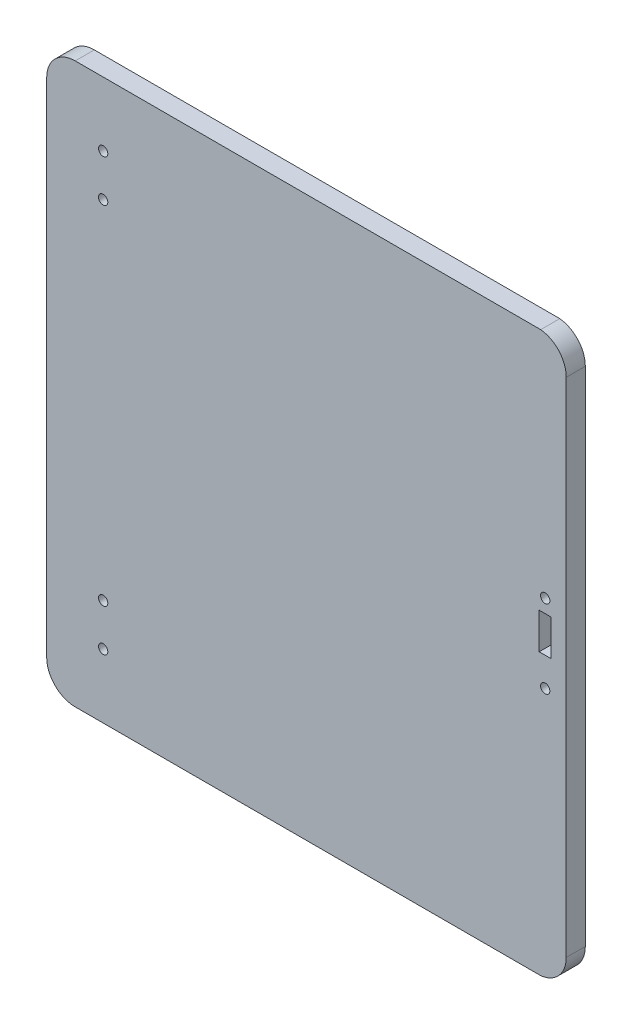
ISO-10303-21;
HEADER;
FILE_DESCRIPTION(('STEP AP214'),'2;1');
FILE_NAME('part.step','',(''),(''),'','','');
FILE_SCHEMA(('AUTOMOTIVE_DESIGN { 1 0 10303 214 1 1 1 1 }'));
ENDSEC;
DATA;
#1=APPLICATION_CONTEXT('core data for automotive mechanical design processes');
#2=APPLICATION_PROTOCOL_DEFINITION('international standard','automotive_design',2000,#1);
#3=PRODUCT_CONTEXT('',#1,'mechanical');
#4=PRODUCT('Part','Part','',(#3));
#5=PRODUCT_RELATED_PRODUCT_CATEGORY('part','',(#4));
#6=PRODUCT_DEFINITION_FORMATION('','',#4);
#7=PRODUCT_DEFINITION_CONTEXT('part definition',#1,'design');
#8=PRODUCT_DEFINITION('design','',#6,#7);
#9=PRODUCT_DEFINITION_SHAPE('','',#8);
#10=(LENGTH_UNIT() NAMED_UNIT(*) SI_UNIT(.MILLI.,.METRE.));
#11=(NAMED_UNIT(*) PLANE_ANGLE_UNIT() SI_UNIT($,.RADIAN.));
#12=(NAMED_UNIT(*) SI_UNIT($,.STERADIAN.) SOLID_ANGLE_UNIT());
#13=UNCERTAINTY_MEASURE_WITH_UNIT(LENGTH_MEASURE(1.E-05),#10,'distance_accuracy_value','');
#14=(GEOMETRIC_REPRESENTATION_CONTEXT(3) GLOBAL_UNCERTAINTY_ASSIGNED_CONTEXT((#13)) GLOBAL_UNIT_ASSIGNED_CONTEXT((#10,
#11,#12)) REPRESENTATION_CONTEXT('',''));
#15=CARTESIAN_POINT('',(0.,0.,0.));
#16=DIRECTION('',(0.,0.,1.));
#17=DIRECTION('',(1.,0.,0.));
#18=AXIS2_PLACEMENT_3D('',#15,#16,#17);
#19=CARTESIAN_POINT('',(76.5001465221911,83.70276267775,6.35));
#20=DIRECTION('',(0.,0.,-1.));
#21=DIRECTION('',(-1.,0.,0.));
#22=AXIS2_PLACEMENT_3D('',#19,#20,#21);
#23=CYLINDRICAL_SURFACE('',#22,9.50000000000003);
#24=CARTESIAN_POINT('',(76.5001465221911,83.70276267775,0.));
#25=DIRECTION('',(0.,0.,1.));
#26=DIRECTION('',(1.,0.,0.));
#27=AXIS2_PLACEMENT_3D('',#24,#25,#26);
#28=CIRCLE('',#27,9.50000000000003);
#29=CARTESIAN_POINT('',(86.,83.65,0.));
#30=VERTEX_POINT('',#29);
#31=CARTESIAN_POINT('',(77.4999999999999,93.15,0.));
#32=VERTEX_POINT('',#31);
#33=EDGE_CURVE('E177',#30,#32,#28,.T.);
#34=ORIENTED_EDGE('',*,*,#33,.T.);
#35=DIRECTION('',(0.,0.,-1.));
#36=VECTOR('',#35,1.);
#37=CARTESIAN_POINT('',(77.4999999999999,93.15,6.35));
#38=LINE('',#37,#36);
#39=CARTESIAN_POINT('',(77.4999999999999,93.15,6.35));
#40=VERTEX_POINT('',#39);
#41=EDGE_CURVE('E11',#40,#32,#38,.T.);
#42=ORIENTED_EDGE('',*,*,#41,.F.);
#43=CARTESIAN_POINT('',(76.5001465221911,83.70276267775,6.35));
#44=DIRECTION('',(0.,0.,1.));
#45=DIRECTION('',(1.,0.,0.));
#46=AXIS2_PLACEMENT_3D('',#43,#44,#45);
#47=CIRCLE('',#46,9.50000000000003);
#48=CARTESIAN_POINT('',(86.,83.65,6.35));
#49=VERTEX_POINT('',#48);
#50=EDGE_CURVE('E183',#49,#40,#47,.T.);
#51=ORIENTED_EDGE('',*,*,#50,.F.);
#52=DIRECTION('',(0.,0.,-1.));
#53=VECTOR('',#52,1.);
#54=CARTESIAN_POINT('',(86.,83.65,6.35));
#55=LINE('',#54,#53);
#56=EDGE_CURVE('E209',#49,#30,#55,.T.);
#57=ORIENTED_EDGE('',*,*,#56,.T.);
#58=EDGE_LOOP('',(#34,#42,#51,#57));
#59=FACE_BOUND('',#58,.T.);
#60=ADVANCED_FACE('F40',(#59),#23,.T.);
#61=CARTESIAN_POINT('',(77.4999999999999,93.15,6.35));
#62=DIRECTION('',(0.,-1.,0.));
#63=DIRECTION('',(1.,0.,0.));
#64=AXIS2_PLACEMENT_3D('',#61,#62,#63);
#65=PLANE('',#64);
#66=DIRECTION('',(-1.,0.,0.));
#67=VECTOR('',#66,1.);
#68=CARTESIAN_POINT('',(77.4999999999999,93.15,0.));
#69=LINE('',#68,#67);
#70=CARTESIAN_POINT('',(-77.4999999999999,93.15,0.));
#71=VERTEX_POINT('',#70);
#72=EDGE_CURVE('E213',#32,#71,#69,.T.);
#73=ORIENTED_EDGE('',*,*,#72,.T.);
#74=DIRECTION('',(0.,0.,-1.));
#75=VECTOR('',#74,1.);
#76=CARTESIAN_POINT('',(-77.4999999999999,93.15,6.35));
#77=LINE('',#76,#75);
#78=CARTESIAN_POINT('',(-77.4999999999999,93.15,6.35));
#79=VERTEX_POINT('',#78);
#80=EDGE_CURVE('E48',#79,#71,#77,.T.);
#81=ORIENTED_EDGE('',*,*,#80,.F.);
#82=DIRECTION('',(-1.,0.,0.));
#83=VECTOR('',#82,1.);
#84=CARTESIAN_POINT('',(77.4999999999999,93.15,6.35));
#85=LINE('',#84,#83);
#86=EDGE_CURVE('E187',#40,#79,#85,.T.);
#87=ORIENTED_EDGE('',*,*,#86,.F.);
#88=ORIENTED_EDGE('',*,*,#41,.T.);
#89=EDGE_LOOP('',(#73,#81,#87,#88));
#90=FACE_BOUND('',#89,.T.);
#91=ADVANCED_FACE('F283',(#90),#65,.F.);
#92=CARTESIAN_POINT('',(-77.5,83.65,6.35));
#93=DIRECTION('',(0.,0.,-1.));
#94=DIRECTION('',(-1.,0.,0.));
#95=AXIS2_PLACEMENT_3D('',#92,#93,#94);
#96=CYLINDRICAL_SURFACE('',#95,9.50000000000001);
#97=CARTESIAN_POINT('',(-77.5,83.65,0.));
#98=DIRECTION('',(0.,0.,1.));
#99=DIRECTION('',(1.,0.,0.));
#100=AXIS2_PLACEMENT_3D('',#97,#98,#99);
#101=CIRCLE('',#100,9.50000000000001);
#102=CARTESIAN_POINT('',(-87.,83.6499999999999,0.));
#103=VERTEX_POINT('',#102);
#104=EDGE_CURVE('E216',#71,#103,#101,.T.);
#105=ORIENTED_EDGE('',*,*,#104,.T.);
#106=DIRECTION('',(0.,0.,-1.));
#107=VECTOR('',#106,1.);
#108=CARTESIAN_POINT('',(-87.,83.6499999999999,6.35));
#109=LINE('',#108,#107);
#110=CARTESIAN_POINT('',(-87.,83.6499999999999,6.35));
#111=VERTEX_POINT('',#110);
#112=EDGE_CURVE('E252',#111,#103,#109,.T.);
#113=ORIENTED_EDGE('',*,*,#112,.F.);
#114=CARTESIAN_POINT('',(-77.5,83.65,6.35));
#115=DIRECTION('',(0.,0.,1.));
#116=DIRECTION('',(1.,0.,0.));
#117=AXIS2_PLACEMENT_3D('',#114,#115,#116);
#118=CIRCLE('',#117,9.50000000000001);
#119=EDGE_CURVE('E191',#79,#111,#118,.T.);
#120=ORIENTED_EDGE('',*,*,#119,.F.);
#121=ORIENTED_EDGE('',*,*,#80,.T.);
#122=EDGE_LOOP('',(#105,#113,#120,#121));
#123=FACE_BOUND('',#122,.T.);
#124=ADVANCED_FACE('F262',(#123),#96,.T.);
#125=CARTESIAN_POINT('',(-87.,83.6499999999999,6.35));
#126=DIRECTION('',(1.,0.,0.));
#127=DIRECTION('',(0.,1.,0.));
#128=AXIS2_PLACEMENT_3D('',#125,#126,#127);
#129=PLANE('',#128);
#130=DIRECTION('',(0.,-1.,0.));
#131=VECTOR('',#130,1.);
#132=CARTESIAN_POINT('',(-87.,83.6499999999999,0.));
#133=LINE('',#132,#131);
#134=CARTESIAN_POINT('',(-87.,-83.65,0.));
#135=VERTEX_POINT('',#134);
#136=EDGE_CURVE('E219',#103,#135,#133,.T.);
#137=ORIENTED_EDGE('',*,*,#136,.T.);
#138=DIRECTION('',(0.,0.,-1.));
#139=VECTOR('',#138,1.);
#140=CARTESIAN_POINT('',(-87.,-83.65,6.35));
#141=LINE('',#140,#139);
#142=CARTESIAN_POINT('',(-87.,-83.65,6.35));
#143=VERTEX_POINT('',#142);
#144=EDGE_CURVE('E248',#143,#135,#141,.T.);
#145=ORIENTED_EDGE('',*,*,#144,.F.);
#146=DIRECTION('',(0.,-1.,0.));
#147=VECTOR('',#146,1.);
#148=CARTESIAN_POINT('',(-87.,83.6499999999999,6.35));
#149=LINE('',#148,#147);
#150=EDGE_CURVE('E194',#111,#143,#149,.T.);
#151=ORIENTED_EDGE('',*,*,#150,.F.);
#152=ORIENTED_EDGE('',*,*,#112,.T.);
#153=EDGE_LOOP('',(#137,#145,#151,#152));
#154=FACE_BOUND('',#153,.T.);
#155=ADVANCED_FACE('F271',(#154),#129,.F.);
#156=CARTESIAN_POINT('',(-77.5,-83.65,6.35));
#157=DIRECTION('',(0.,0.,-1.));
#158=DIRECTION('',(-1.,0.,0.));
#159=AXIS2_PLACEMENT_3D('',#156,#157,#158);
#160=CYLINDRICAL_SURFACE('',#159,9.50000000000001);
#161=CARTESIAN_POINT('',(-77.5,-83.65,0.));
#162=DIRECTION('',(0.,0.,1.));
#163=DIRECTION('',(1.,0.,0.));
#164=AXIS2_PLACEMENT_3D('',#161,#162,#163);
#165=CIRCLE('',#164,9.50000000000001);
#166=CARTESIAN_POINT('',(-77.4999999999999,-93.15,0.));
#167=VERTEX_POINT('',#166);
#168=EDGE_CURVE('E222',#135,#167,#165,.T.);
#169=ORIENTED_EDGE('',*,*,#168,.T.);
#170=DIRECTION('',(0.,0.,-1.));
#171=VECTOR('',#170,1.);
#172=CARTESIAN_POINT('',(-77.4999999999999,-93.15,6.35));
#173=LINE('',#172,#171);
#174=CARTESIAN_POINT('',(-77.4999999999999,-93.15,6.35));
#175=VERTEX_POINT('',#174);
#176=EDGE_CURVE('E244',#175,#167,#173,.T.);
#177=ORIENTED_EDGE('',*,*,#176,.F.);
#178=CARTESIAN_POINT('',(-77.5,-83.65,6.35));
#179=DIRECTION('',(0.,0.,1.));
#180=DIRECTION('',(1.,0.,0.));
#181=AXIS2_PLACEMENT_3D('',#178,#179,#180);
#182=CIRCLE('',#181,9.50000000000001);
#183=EDGE_CURVE('E197',#143,#175,#182,.T.);
#184=ORIENTED_EDGE('',*,*,#183,.F.);
#185=ORIENTED_EDGE('',*,*,#144,.T.);
#186=EDGE_LOOP('',(#169,#177,#184,#185));
#187=FACE_BOUND('',#186,.T.);
#188=ADVANCED_FACE('F275',(#187),#160,.T.);
#189=CARTESIAN_POINT('',(77.4999999999999,-93.15,6.35));
#190=DIRECTION('',(0.,1.,0.));
#191=DIRECTION('',(-1.,0.,0.));
#192=AXIS2_PLACEMENT_3D('',#189,#190,#191);
#193=PLANE('',#192);
#194=DIRECTION('',(1.,0.,0.));
#195=VECTOR('',#194,1.);
#196=CARTESIAN_POINT('',(77.4999999999999,-93.15,0.));
#197=LINE('',#196,#195);
#198=CARTESIAN_POINT('',(77.4999999999999,-93.15,0.));
#199=VERTEX_POINT('',#198);
#200=EDGE_CURVE('E225',#167,#199,#197,.T.);
#201=ORIENTED_EDGE('',*,*,#200,.T.);
#202=DIRECTION('',(0.,0.,-1.));
#203=VECTOR('',#202,1.);
#204=CARTESIAN_POINT('',(77.4999999999999,-93.15,6.35));
#205=LINE('',#204,#203);
#206=CARTESIAN_POINT('',(77.4999999999999,-93.15,6.35));
#207=VERTEX_POINT('',#206);
#208=EDGE_CURVE('E240',#207,#199,#205,.T.);
#209=ORIENTED_EDGE('',*,*,#208,.F.);
#210=DIRECTION('',(1.,0.,0.));
#211=VECTOR('',#210,1.);
#212=CARTESIAN_POINT('',(77.4999999999999,-93.15,6.35));
#213=LINE('',#212,#211);
#214=EDGE_CURVE('E200',#175,#207,#213,.T.);
#215=ORIENTED_EDGE('',*,*,#214,.F.);
#216=ORIENTED_EDGE('',*,*,#176,.T.);
#217=EDGE_LOOP('',(#201,#209,#215,#216));
#218=FACE_BOUND('',#217,.T.);
#219=ADVANCED_FACE('F296',(#218),#193,.F.);
#220=CARTESIAN_POINT('',(76.5001465221912,-83.70276267775,6.35));
#221=DIRECTION('',(0.,0.,-1.));
#222=DIRECTION('',(-1.,0.,0.));
#223=AXIS2_PLACEMENT_3D('',#220,#221,#222);
#224=CYLINDRICAL_SURFACE('',#223,9.49999999999996);
#225=CARTESIAN_POINT('',(76.5001465221912,-83.70276267775,0.));
#226=DIRECTION('',(0.,0.,1.));
#227=DIRECTION('',(1.,0.,0.));
#228=AXIS2_PLACEMENT_3D('',#225,#226,#227);
#229=CIRCLE('',#228,9.49999999999996);
#230=CARTESIAN_POINT('',(86.,-83.6499999999999,0.));
#231=VERTEX_POINT('',#230);
#232=EDGE_CURVE('E228',#199,#231,#229,.T.);
#233=ORIENTED_EDGE('',*,*,#232,.T.);
#234=DIRECTION('',(0.,0.,-1.));
#235=VECTOR('',#234,1.);
#236=CARTESIAN_POINT('',(86.,-83.6499999999999,6.35));
#237=LINE('',#236,#235);
#238=CARTESIAN_POINT('',(86.,-83.6499999999999,6.35));
#239=VERTEX_POINT('',#238);
#240=EDGE_CURVE('E236',#239,#231,#237,.T.);
#241=ORIENTED_EDGE('',*,*,#240,.F.);
#242=CARTESIAN_POINT('',(76.5001465221912,-83.70276267775,6.35));
#243=DIRECTION('',(0.,0.,1.));
#244=DIRECTION('',(1.,0.,0.));
#245=AXIS2_PLACEMENT_3D('',#242,#243,#244);
#246=CIRCLE('',#245,9.49999999999996);
#247=EDGE_CURVE('E203',#207,#239,#246,.T.);
#248=ORIENTED_EDGE('',*,*,#247,.F.);
#249=ORIENTED_EDGE('',*,*,#208,.T.);
#250=EDGE_LOOP('',(#233,#241,#248,#249));
#251=FACE_BOUND('',#250,.T.);
#252=ADVANCED_FACE('F294',(#251),#224,.T.);
#253=CARTESIAN_POINT('',(86.,83.65,6.35));
#254=DIRECTION('',(-1.,0.,0.));
#255=DIRECTION('',(0.,0.,1.));
#256=AXIS2_PLACEMENT_3D('',#253,#254,#255);
#257=PLANE('',#256);
#258=DIRECTION('',(0.,1.,0.));
#259=VECTOR('',#258,1.);
#260=CARTESIAN_POINT('',(86.,83.65,0.));
#261=LINE('',#260,#259);
#262=EDGE_CURVE('E188',#231,#30,#261,.T.);
#263=ORIENTED_EDGE('',*,*,#262,.T.);
#264=ORIENTED_EDGE('',*,*,#56,.F.);
#265=DIRECTION('',(0.,1.,0.));
#266=VECTOR('',#265,1.);
#267=CARTESIAN_POINT('',(86.,83.65,6.35));
#268=LINE('',#267,#266);
#269=EDGE_CURVE('E206',#239,#49,#268,.T.);
#270=ORIENTED_EDGE('',*,*,#269,.F.);
#271=ORIENTED_EDGE('',*,*,#240,.T.);
#272=EDGE_LOOP('',(#263,#264,#270,#271));
#273=FACE_BOUND('',#272,.T.);
#274=ADVANCED_FACE('F289',(#273),#257,.F.);
#275=CARTESIAN_POINT('',(76.5001465221911,83.70276267775,6.35));
#276=DIRECTION('',(0.,0.,1.));
#277=DIRECTION('',(1.,0.,0.));
#278=AXIS2_PLACEMENT_3D('',#275,#276,#277);
#279=PLANE('',#278);
#280=CARTESIAN_POINT('',(79.,16.45,6.35));
#281=DIRECTION('',(0.,0.,1.));
#282=DIRECTION('',(1.,0.,0.));
#283=AXIS2_PLACEMENT_3D('',#280,#281,#282);
#284=CIRCLE('',#283,1.54999999999999);
#285=CARTESIAN_POINT('',(80.55,16.45,6.35));
#286=VERTEX_POINT('',#285);
#287=EDGE_CURVE('E518',#286,#286,#284,.T.);
#288=ORIENTED_EDGE('',*,*,#287,.F.);
#289=EDGE_LOOP('',(#288));
#290=FACE_BOUND('',#289,.T.);
#291=CARTESIAN_POINT('',(79.,-9.55,6.35));
#292=DIRECTION('',(0.,0.,1.));
#293=DIRECTION('',(1.,0.,0.));
#294=AXIS2_PLACEMENT_3D('',#291,#292,#293);
#295=CIRCLE('',#294,1.54999999999999);
#296=CARTESIAN_POINT('',(80.55,-9.55,6.35));
#297=VERTEX_POINT('',#296);
#298=EDGE_CURVE('E527',#297,#297,#295,.T.);
#299=ORIENTED_EDGE('',*,*,#298,.F.);
#300=EDGE_LOOP('',(#299));
#301=FACE_BOUND('',#300,.T.);
#302=CARTESIAN_POINT('',(-68.2,71.8,6.35));
#303=DIRECTION('',(0.,0.,1.));
#304=DIRECTION('',(1.,0.,0.));
#305=AXIS2_PLACEMENT_3D('',#302,#303,#304);
#306=CIRCLE('',#305,1.54999999999999);
#307=CARTESIAN_POINT('',(-66.65,71.8,6.35));
#308=VERTEX_POINT('',#307);
#309=EDGE_CURVE('E536',#308,#308,#306,.T.);
#310=ORIENTED_EDGE('',*,*,#309,.F.);
#311=EDGE_LOOP('',(#310));
#312=FACE_BOUND('',#311,.T.);
#313=CARTESIAN_POINT('',(-68.2,57.8,6.35));
#314=DIRECTION('',(0.,0.,1.));
#315=DIRECTION('',(1.,0.,0.));
#316=AXIS2_PLACEMENT_3D('',#313,#314,#315);
#317=CIRCLE('',#316,1.54999999999999);
#318=CARTESIAN_POINT('',(-66.65,57.8,6.35));
#319=VERTEX_POINT('',#318);
#320=EDGE_CURVE('E544',#319,#319,#317,.T.);
#321=ORIENTED_EDGE('',*,*,#320,.F.);
#322=EDGE_LOOP('',(#321));
#323=FACE_BOUND('',#322,.T.);
#324=CARTESIAN_POINT('',(-68.2,-57.8,6.35));
#325=DIRECTION('',(0.,0.,1.));
#326=DIRECTION('',(-1.,0.,0.));
#327=AXIS2_PLACEMENT_3D('',#324,#325,#326);
#328=CIRCLE('',#327,1.54999999999999);
#329=CARTESIAN_POINT('',(-69.75,-57.8,6.35));
#330=VERTEX_POINT('',#329);
#331=EDGE_CURVE('E552',#330,#330,#328,.T.);
#332=ORIENTED_EDGE('',*,*,#331,.F.);
#333=EDGE_LOOP('',(#332));
#334=FACE_BOUND('',#333,.T.);
#335=CARTESIAN_POINT('',(-68.2,-71.8,6.35));
#336=DIRECTION('',(0.,0.,1.));
#337=DIRECTION('',(-1.,0.,0.));
#338=AXIS2_PLACEMENT_3D('',#335,#336,#337);
#339=CIRCLE('',#338,1.54999999999999);
#340=CARTESIAN_POINT('',(-69.75,-71.8,6.35));
#341=VERTEX_POINT('',#340);
#342=EDGE_CURVE('E158',#341,#341,#339,.T.);
#343=ORIENTED_EDGE('',*,*,#342,.F.);
#344=EDGE_LOOP('',(#343));
#345=FACE_BOUND('',#344,.T.);
#346=DIRECTION('',(0.,1.,0.));
#347=VECTOR('',#346,1.);
#348=CARTESIAN_POINT('',(81.,0.,6.35));
#349=LINE('',#348,#347);
#350=CARTESIAN_POINT('',(81.,0.,6.35));
#351=VERTEX_POINT('',#350);
#352=CARTESIAN_POINT('',(81.,12.,6.35));
#353=VERTEX_POINT('',#352);
#354=EDGE_CURVE('E55',#351,#353,#349,.T.);
#355=ORIENTED_EDGE('',*,*,#354,.F.);
#356=DIRECTION('',(1.,0.,0.));
#357=VECTOR('',#356,1.);
#358=CARTESIAN_POINT('',(81.,0.,6.35));
#359=LINE('',#358,#357);
#360=CARTESIAN_POINT('',(77.,0.,6.35));
#361=VERTEX_POINT('',#360);
#362=EDGE_CURVE('E150',#361,#351,#359,.T.);
#363=ORIENTED_EDGE('',*,*,#362,.F.);
#364=DIRECTION('',(0.,-1.,0.));
#365=VECTOR('',#364,1.);
#366=CARTESIAN_POINT('',(77.,0.,6.35));
#367=LINE('',#366,#365);
#368=CARTESIAN_POINT('',(77.,12.,6.35));
#369=VERTEX_POINT('',#368);
#370=EDGE_CURVE('E155',#369,#361,#367,.T.);
#371=ORIENTED_EDGE('',*,*,#370,.F.);
#372=DIRECTION('',(-1.,0.,0.));
#373=VECTOR('',#372,1.);
#374=CARTESIAN_POINT('',(81.,12.,6.35));
#375=LINE('',#374,#373);
#376=EDGE_CURVE('E167',#353,#369,#375,.T.);
#377=ORIENTED_EDGE('',*,*,#376,.F.);
#378=EDGE_LOOP('',(#355,#363,#371,#377));
#379=FACE_BOUND('',#378,.T.);
#380=ORIENTED_EDGE('',*,*,#50,.T.);
#381=ORIENTED_EDGE('',*,*,#86,.T.);
#382=ORIENTED_EDGE('',*,*,#119,.T.);
#383=ORIENTED_EDGE('',*,*,#150,.T.);
#384=ORIENTED_EDGE('',*,*,#183,.T.);
#385=ORIENTED_EDGE('',*,*,#214,.T.);
#386=ORIENTED_EDGE('',*,*,#247,.T.);
#387=ORIENTED_EDGE('',*,*,#269,.T.);
#388=EDGE_LOOP('',(#380,#381,#382,#383,#384,#385,#386,#387));
#389=FACE_BOUND('',#388,.T.);
#390=ADVANCED_FACE('F279',(#290,#301,#312,#323,#334,#345,#379,#389),#279,.T.);
#391=CARTESIAN_POINT('',(76.5001465221911,83.70276267775,0.));
#392=DIRECTION('',(0.,0.,1.));
#393=DIRECTION('',(1.,0.,0.));
#394=AXIS2_PLACEMENT_3D('',#391,#392,#393);
#395=PLANE('',#394);
#396=CARTESIAN_POINT('',(79.,16.45,0.));
#397=DIRECTION('',(0.,0.,1.));
#398=DIRECTION('',(1.,0.,0.));
#399=AXIS2_PLACEMENT_3D('',#396,#397,#398);
#400=CIRCLE('',#399,1.54999999999999);
#401=CARTESIAN_POINT('',(80.55,16.45,0.));
#402=VERTEX_POINT('',#401);
#403=EDGE_CURVE('E515',#402,#402,#400,.T.);
#404=ORIENTED_EDGE('',*,*,#403,.T.);
#405=EDGE_LOOP('',(#404));
#406=FACE_BOUND('',#405,.T.);
#407=CARTESIAN_POINT('',(79.,-9.55,0.));
#408=DIRECTION('',(0.,0.,1.));
#409=DIRECTION('',(1.,0.,0.));
#410=AXIS2_PLACEMENT_3D('',#407,#408,#409);
#411=CIRCLE('',#410,1.54999999999999);
#412=CARTESIAN_POINT('',(80.55,-9.55,0.));
#413=VERTEX_POINT('',#412);
#414=EDGE_CURVE('E520',#413,#413,#411,.T.);
#415=ORIENTED_EDGE('',*,*,#414,.T.);
#416=EDGE_LOOP('',(#415));
#417=FACE_BOUND('',#416,.T.);
#418=CARTESIAN_POINT('',(-68.2,71.8,0.));
#419=DIRECTION('',(0.,0.,1.));
#420=DIRECTION('',(1.,0.,0.));
#421=AXIS2_PLACEMENT_3D('',#418,#419,#420);
#422=CIRCLE('',#421,1.54999999999999);
#423=CARTESIAN_POINT('',(-66.65,71.8,0.));
#424=VERTEX_POINT('',#423);
#425=EDGE_CURVE('E168',#424,#424,#422,.T.);
#426=ORIENTED_EDGE('',*,*,#425,.T.);
#427=EDGE_LOOP('',(#426));
#428=FACE_BOUND('',#427,.T.);
#429=CARTESIAN_POINT('',(-68.2,57.8,0.));
#430=DIRECTION('',(0.,0.,1.));
#431=DIRECTION('',(1.,0.,0.));
#432=AXIS2_PLACEMENT_3D('',#429,#430,#431);
#433=CIRCLE('',#432,1.54999999999999);
#434=CARTESIAN_POINT('',(-66.65,57.8,0.));
#435=VERTEX_POINT('',#434);
#436=EDGE_CURVE('E540',#435,#435,#433,.T.);
#437=ORIENTED_EDGE('',*,*,#436,.T.);
#438=EDGE_LOOP('',(#437));
#439=FACE_BOUND('',#438,.T.);
#440=CARTESIAN_POINT('',(-68.2,-57.8,0.));
#441=DIRECTION('',(0.,0.,1.));
#442=DIRECTION('',(-1.,0.,0.));
#443=AXIS2_PLACEMENT_3D('',#440,#441,#442);
#444=CIRCLE('',#443,1.54999999999999);
#445=CARTESIAN_POINT('',(-69.75,-57.8,0.));
#446=VERTEX_POINT('',#445);
#447=EDGE_CURVE('E548',#446,#446,#444,.T.);
#448=ORIENTED_EDGE('',*,*,#447,.T.);
#449=EDGE_LOOP('',(#448));
#450=FACE_BOUND('',#449,.T.);
#451=CARTESIAN_POINT('',(-68.2,-71.8,0.));
#452=DIRECTION('',(0.,0.,1.));
#453=DIRECTION('',(-1.,0.,0.));
#454=AXIS2_PLACEMENT_3D('',#451,#452,#453);
#455=CIRCLE('',#454,1.54999999999999);
#456=CARTESIAN_POINT('',(-69.75,-71.8,0.));
#457=VERTEX_POINT('',#456);
#458=EDGE_CURVE('E555',#457,#457,#455,.T.);
#459=ORIENTED_EDGE('',*,*,#458,.T.);
#460=EDGE_LOOP('',(#459));
#461=FACE_BOUND('',#460,.T.);
#462=DIRECTION('',(1.,0.,0.));
#463=VECTOR('',#462,1.);
#464=CARTESIAN_POINT('',(81.,0.,0.));
#465=LINE('',#464,#463);
#466=CARTESIAN_POINT('',(77.,0.,0.));
#467=VERTEX_POINT('',#466);
#468=CARTESIAN_POINT('',(81.,0.,0.));
#469=VERTEX_POINT('',#468);
#470=EDGE_CURVE('E138',#467,#469,#465,.T.);
#471=ORIENTED_EDGE('',*,*,#470,.T.);
#472=DIRECTION('',(0.,1.,0.));
#473=VECTOR('',#472,1.);
#474=CARTESIAN_POINT('',(81.,0.,0.));
#475=LINE('',#474,#473);
#476=CARTESIAN_POINT('',(81.,12.,0.));
#477=VERTEX_POINT('',#476);
#478=EDGE_CURVE('E131',#469,#477,#475,.T.);
#479=ORIENTED_EDGE('',*,*,#478,.T.);
#480=DIRECTION('',(-1.,0.,0.));
#481=VECTOR('',#480,1.);
#482=CARTESIAN_POINT('',(81.,12.,0.));
#483=LINE('',#482,#481);
#484=CARTESIAN_POINT('',(77.,12.,0.));
#485=VERTEX_POINT('',#484);
#486=EDGE_CURVE('E141',#477,#485,#483,.T.);
#487=ORIENTED_EDGE('',*,*,#486,.T.);
#488=DIRECTION('',(0.,-1.,0.));
#489=VECTOR('',#488,1.);
#490=CARTESIAN_POINT('',(77.,0.,0.));
#491=LINE('',#490,#489);
#492=EDGE_CURVE('E63',#485,#467,#491,.T.);
#493=ORIENTED_EDGE('',*,*,#492,.T.);
#494=EDGE_LOOP('',(#471,#479,#487,#493));
#495=FACE_BOUND('',#494,.T.);
#496=ORIENTED_EDGE('',*,*,#33,.F.);
#497=ORIENTED_EDGE('',*,*,#262,.F.);
#498=ORIENTED_EDGE('',*,*,#232,.F.);
#499=ORIENTED_EDGE('',*,*,#200,.F.);
#500=ORIENTED_EDGE('',*,*,#168,.F.);
#501=ORIENTED_EDGE('',*,*,#136,.F.);
#502=ORIENTED_EDGE('',*,*,#104,.F.);
#503=ORIENTED_EDGE('',*,*,#72,.F.);
#504=EDGE_LOOP('',(#496,#497,#498,#499,#500,#501,#502,#503));
#505=FACE_BOUND('',#504,.T.);
#506=ADVANCED_FACE('F146',(#406,#417,#428,#439,#450,#461,#495,#505),#395,.F.);
#507=CARTESIAN_POINT('',(81.,0.,0.));
#508=DIRECTION('',(1.,0.,0.));
#509=DIRECTION('',(0.,0.,-1.));
#510=AXIS2_PLACEMENT_3D('',#507,#508,#509);
#511=PLANE('',#510);
#512=ORIENTED_EDGE('',*,*,#354,.T.);
#513=DIRECTION('',(0.,0.,1.));
#514=VECTOR('',#513,1.);
#515=CARTESIAN_POINT('',(81.,12.,0.));
#516=LINE('',#515,#514);
#517=EDGE_CURVE('E127',#477,#353,#516,.T.);
#518=ORIENTED_EDGE('',*,*,#517,.F.);
#519=ORIENTED_EDGE('',*,*,#478,.F.);
#520=DIRECTION('',(0.,0.,1.));
#521=VECTOR('',#520,1.);
#522=CARTESIAN_POINT('',(81.,0.,0.));
#523=LINE('',#522,#521);
#524=EDGE_CURVE('E174',#469,#351,#523,.T.);
#525=ORIENTED_EDGE('',*,*,#524,.T.);
#526=EDGE_LOOP('',(#512,#518,#519,#525));
#527=FACE_BOUND('',#526,.T.);
#528=ADVANCED_FACE('F129',(#527),#511,.F.);
#529=CARTESIAN_POINT('',(81.,0.,0.));
#530=DIRECTION('',(0.,-1.,0.));
#531=DIRECTION('',(1.,0.,0.));
#532=AXIS2_PLACEMENT_3D('',#529,#530,#531);
#533=PLANE('',#532);
#534=ORIENTED_EDGE('',*,*,#362,.T.);
#535=ORIENTED_EDGE('',*,*,#524,.F.);
#536=ORIENTED_EDGE('',*,*,#470,.F.);
#537=DIRECTION('',(0.,0.,1.));
#538=VECTOR('',#537,1.);
#539=CARTESIAN_POINT('',(77.,0.,0.));
#540=LINE('',#539,#538);
#541=EDGE_CURVE('E178',#467,#361,#540,.T.);
#542=ORIENTED_EDGE('',*,*,#541,.T.);
#543=EDGE_LOOP('',(#534,#535,#536,#542));
#544=FACE_BOUND('',#543,.T.);
#545=ADVANCED_FACE('F370',(#544),#533,.F.);
#546=CARTESIAN_POINT('',(77.,0.,0.));
#547=DIRECTION('',(-1.,0.,0.));
#548=DIRECTION('',(0.,0.,1.));
#549=AXIS2_PLACEMENT_3D('',#546,#547,#548);
#550=PLANE('',#549);
#551=ORIENTED_EDGE('',*,*,#370,.T.);
#552=ORIENTED_EDGE('',*,*,#541,.F.);
#553=ORIENTED_EDGE('',*,*,#492,.F.);
#554=DIRECTION('',(0.,0.,1.));
#555=VECTOR('',#554,1.);
#556=CARTESIAN_POINT('',(77.,12.,0.));
#557=LINE('',#556,#555);
#558=EDGE_CURVE('E137',#485,#369,#557,.T.);
#559=ORIENTED_EDGE('',*,*,#558,.T.);
#560=EDGE_LOOP('',(#551,#552,#553,#559));
#561=FACE_BOUND('',#560,.T.);
#562=ADVANCED_FACE('F379',(#561),#550,.F.);
#563=CARTESIAN_POINT('',(81.,12.,0.));
#564=DIRECTION('',(0.,1.,0.));
#565=DIRECTION('',(0.,0.,1.));
#566=AXIS2_PLACEMENT_3D('',#563,#564,#565);
#567=PLANE('',#566);
#568=ORIENTED_EDGE('',*,*,#376,.T.);
#569=ORIENTED_EDGE('',*,*,#558,.F.);
#570=ORIENTED_EDGE('',*,*,#486,.F.);
#571=ORIENTED_EDGE('',*,*,#517,.T.);
#572=EDGE_LOOP('',(#568,#569,#570,#571));
#573=FACE_BOUND('',#572,.T.);
#574=ADVANCED_FACE('F142',(#573),#567,.F.);
#575=CARTESIAN_POINT('',(-68.2,-71.8,0.));
#576=DIRECTION('',(0.,0.,1.));
#577=DIRECTION('',(1.,0.,0.));
#578=AXIS2_PLACEMENT_3D('',#575,#576,#577);
#579=CYLINDRICAL_SURFACE('',#578,1.54999999999999);
#580=ORIENTED_EDGE('',*,*,#458,.F.);
#581=EDGE_LOOP('',(#580));
#582=FACE_BOUND('',#581,.T.);
#583=ORIENTED_EDGE('',*,*,#342,.T.);
#584=EDGE_LOOP('',(#583));
#585=FACE_BOUND('',#584,.T.);
#586=ADVANCED_FACE('F397',(#582,#585),#579,.F.);
#587=CARTESIAN_POINT('',(-68.2,-57.8,0.));
#588=DIRECTION('',(0.,0.,1.));
#589=DIRECTION('',(1.,0.,0.));
#590=AXIS2_PLACEMENT_3D('',#587,#588,#589);
#591=CYLINDRICAL_SURFACE('',#590,1.54999999999999);
#592=ORIENTED_EDGE('',*,*,#447,.F.);
#593=EDGE_LOOP('',(#592));
#594=FACE_BOUND('',#593,.T.);
#595=ORIENTED_EDGE('',*,*,#331,.T.);
#596=EDGE_LOOP('',(#595));
#597=FACE_BOUND('',#596,.T.);
#598=ADVANCED_FACE('F406',(#594,#597),#591,.F.);
#599=CARTESIAN_POINT('',(-68.2,57.8,0.));
#600=DIRECTION('',(0.,0.,1.));
#601=DIRECTION('',(1.,0.,0.));
#602=AXIS2_PLACEMENT_3D('',#599,#600,#601);
#603=CYLINDRICAL_SURFACE('',#602,1.54999999999999);
#604=ORIENTED_EDGE('',*,*,#436,.F.);
#605=EDGE_LOOP('',(#604));
#606=FACE_BOUND('',#605,.T.);
#607=ORIENTED_EDGE('',*,*,#320,.T.);
#608=EDGE_LOOP('',(#607));
#609=FACE_BOUND('',#608,.T.);
#610=ADVANCED_FACE('F416',(#606,#609),#603,.F.);
#611=CARTESIAN_POINT('',(-68.2,71.8,0.));
#612=DIRECTION('',(0.,0.,1.));
#613=DIRECTION('',(1.,0.,0.));
#614=AXIS2_PLACEMENT_3D('',#611,#612,#613);
#615=CYLINDRICAL_SURFACE('',#614,1.54999999999999);
#616=ORIENTED_EDGE('',*,*,#425,.F.);
#617=EDGE_LOOP('',(#616));
#618=FACE_BOUND('',#617,.T.);
#619=ORIENTED_EDGE('',*,*,#309,.T.);
#620=EDGE_LOOP('',(#619));
#621=FACE_BOUND('',#620,.T.);
#622=ADVANCED_FACE('F426',(#618,#621),#615,.F.);
#623=CARTESIAN_POINT('',(79.,-9.55,0.));
#624=DIRECTION('',(0.,0.,1.));
#625=DIRECTION('',(1.,0.,0.));
#626=AXIS2_PLACEMENT_3D('',#623,#624,#625);
#627=CYLINDRICAL_SURFACE('',#626,1.54999999999999);
#628=ORIENTED_EDGE('',*,*,#414,.F.);
#629=EDGE_LOOP('',(#628));
#630=FACE_BOUND('',#629,.T.);
#631=ORIENTED_EDGE('',*,*,#298,.T.);
#632=EDGE_LOOP('',(#631));
#633=FACE_BOUND('',#632,.T.);
#634=ADVANCED_FACE('F435',(#630,#633),#627,.F.);
#635=CARTESIAN_POINT('',(79.,16.45,0.));
#636=DIRECTION('',(0.,0.,1.));
#637=DIRECTION('',(1.,0.,0.));
#638=AXIS2_PLACEMENT_3D('',#635,#636,#637);
#639=CYLINDRICAL_SURFACE('',#638,1.54999999999999);
#640=ORIENTED_EDGE('',*,*,#403,.F.);
#641=EDGE_LOOP('',(#640));
#642=FACE_BOUND('',#641,.T.);
#643=ORIENTED_EDGE('',*,*,#287,.T.);
#644=EDGE_LOOP('',(#643));
#645=FACE_BOUND('',#644,.T.);
#646=ADVANCED_FACE('F444',(#642,#645),#639,.F.);
#647=CLOSED_SHELL('',(#60,#91,#124,#155,#188,#219,#252,#274,#390,#506,#528,#545,#562,#574,#586,
#598,#610,#622,#634,#646));
#648=MANIFOLD_SOLID_BREP('B2',#647);
#649=ADVANCED_BREP_SHAPE_REPRESENTATION('',(#18,#648),#14);
#650=SHAPE_DEFINITION_REPRESENTATION(#9,#649);
ENDSEC;
END-ISO-10303-21;
